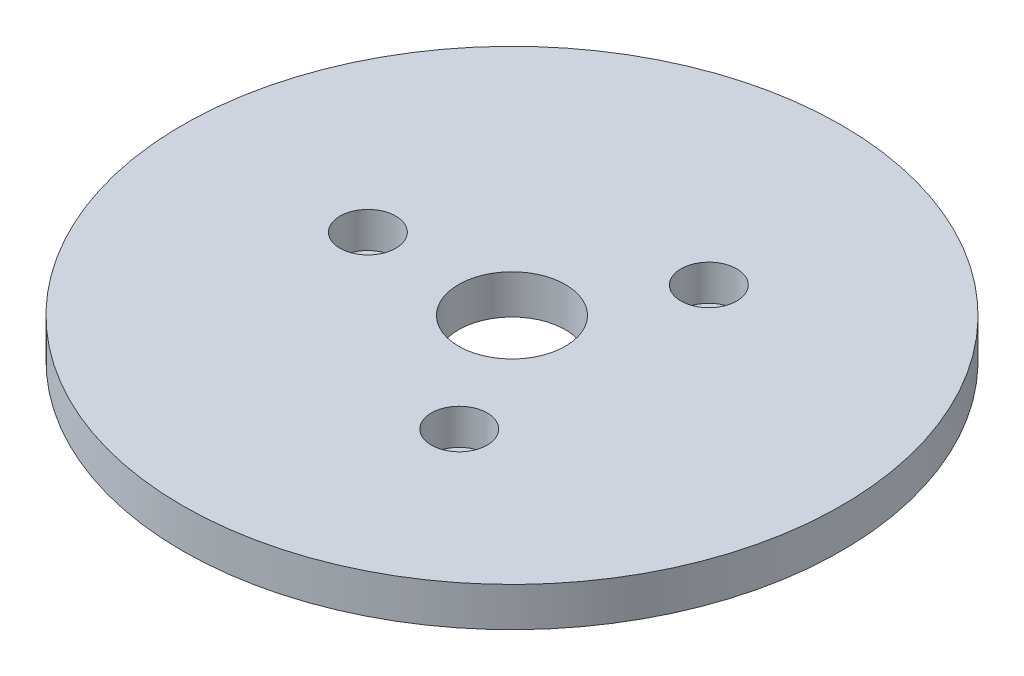
ISO-10303-21;
HEADER;
FILE_DESCRIPTION(('STEP AP214'),'2;1');
FILE_NAME('part.step','',(''),(''),'','','');
FILE_SCHEMA(('AUTOMOTIVE_DESIGN { 1 0 10303 214 1 1 1 1 }'));
ENDSEC;
DATA;
#1=APPLICATION_CONTEXT('core data for automotive mechanical design processes');
#2=APPLICATION_PROTOCOL_DEFINITION('international standard','automotive_design',2000,#1);
#3=PRODUCT_CONTEXT('',#1,'mechanical');
#4=PRODUCT('Part','Part','',(#3));
#5=PRODUCT_RELATED_PRODUCT_CATEGORY('part','',(#4));
#6=PRODUCT_DEFINITION_FORMATION('','',#4);
#7=PRODUCT_DEFINITION_CONTEXT('part definition',#1,'design');
#8=PRODUCT_DEFINITION('design','',#6,#7);
#9=PRODUCT_DEFINITION_SHAPE('','',#8);
#10=(LENGTH_UNIT() NAMED_UNIT(*) SI_UNIT(.MILLI.,.METRE.));
#11=(NAMED_UNIT(*) PLANE_ANGLE_UNIT() SI_UNIT($,.RADIAN.));
#12=(NAMED_UNIT(*) SI_UNIT($,.STERADIAN.) SOLID_ANGLE_UNIT());
#13=UNCERTAINTY_MEASURE_WITH_UNIT(LENGTH_MEASURE(1.E-05),#10,'distance_accuracy_value','');
#14=(GEOMETRIC_REPRESENTATION_CONTEXT(3) GLOBAL_UNCERTAINTY_ASSIGNED_CONTEXT((#13)) GLOBAL_UNIT_ASSIGNED_CONTEXT((#10,
#11,#12)) REPRESENTATION_CONTEXT('',''));
#15=CARTESIAN_POINT('',(0.,0.,0.));
#16=DIRECTION('',(0.,0.,1.));
#17=DIRECTION('',(1.,0.,0.));
#18=AXIS2_PLACEMENT_3D('',#15,#16,#17);
#19=CARTESIAN_POINT('',(0.,11.,0.));
#20=DIRECTION('',(0.,-1.,0.));
#21=DIRECTION('',(0.,0.,-1.));
#22=AXIS2_PLACEMENT_3D('',#19,#20,#21);
#23=CYLINDRICAL_SURFACE('',#22,92.5);
#24=CARTESIAN_POINT('',(0.,11.,0.));
#25=DIRECTION('',(0.,1.,0.));
#26=DIRECTION('',(0.,0.,1.));
#27=AXIS2_PLACEMENT_3D('',#24,#25,#26);
#28=CIRCLE('',#27,92.5);
#29=CARTESIAN_POINT('',(0.,11.,92.5));
#30=VERTEX_POINT('',#29);
#31=EDGE_CURVE('E10',#30,#30,#28,.T.);
#32=ORIENTED_EDGE('',*,*,#31,.F.);
#33=EDGE_LOOP('',(#32));
#34=FACE_BOUND('',#33,.T.);
#35=CARTESIAN_POINT('',(0.,0.,0.));
#36=DIRECTION('',(0.,1.,0.));
#37=DIRECTION('',(0.,0.,1.));
#38=AXIS2_PLACEMENT_3D('',#35,#36,#37);
#39=CIRCLE('',#38,92.5);
#40=CARTESIAN_POINT('',(0.,0.,92.5));
#41=VERTEX_POINT('',#40);
#42=EDGE_CURVE('E37',#41,#41,#39,.T.);
#43=ORIENTED_EDGE('',*,*,#42,.T.);
#44=EDGE_LOOP('',(#43));
#45=FACE_BOUND('',#44,.T.);
#46=ADVANCED_FACE('F40',(#34,#45),#23,.T.);
#47=CARTESIAN_POINT('',(0.,11.,0.));
#48=DIRECTION('',(0.,1.,0.));
#49=DIRECTION('',(0.,0.,1.));
#50=AXIS2_PLACEMENT_3D('',#47,#48,#49);
#51=PLANE('',#50);
#52=CARTESIAN_POINT('',(20.2230390066846,11.,35.0273310430247));
#53=DIRECTION('',(0.,1.,0.));
#54=DIRECTION('',(0.866025403784436,0.,-0.500000000000004));
#55=AXIS2_PLACEMENT_3D('',#52,#53,#54);
#56=CIRCLE('',#55,7.83759726769559);
#57=CARTESIAN_POINT('',(27.0105973451405,11.,31.1085324091768));
#58=VERTEX_POINT('',#57);
#59=EDGE_CURVE('E70',#58,#58,#56,.T.);
#60=ORIENTED_EDGE('',*,*,#59,.F.);
#61=EDGE_LOOP('',(#60));
#62=FACE_BOUND('',#61,.T.);
#63=CARTESIAN_POINT('',(20.2230390066841,11.,-35.0273310430249));
#64=DIRECTION('',(0.,1.,0.));
#65=DIRECTION('',(-0.866025403784443,0.,-0.499999999999992));
#66=AXIS2_PLACEMENT_3D('',#63,#64,#65);
#67=CIRCLE('',#66,7.83759726769559);
#68=CARTESIAN_POINT('',(13.4354806682282,11.,-38.9461296768727));
#69=VERTEX_POINT('',#68);
#70=EDGE_CURVE('E61',#69,#69,#67,.T.);
#71=ORIENTED_EDGE('',*,*,#70,.F.);
#72=EDGE_LOOP('',(#71));
#73=FACE_BOUND('',#72,.T.);
#74=CARTESIAN_POINT('',(-40.4460780133689,11.,0.));
#75=DIRECTION('',(0.,1.,0.));
#76=DIRECTION('',(0.,0.,1.));
#77=AXIS2_PLACEMENT_3D('',#74,#75,#76);
#78=CIRCLE('',#77,7.83759726769559);
#79=CARTESIAN_POINT('',(-40.4460780133689,11.,7.83759726769559));
#80=VERTEX_POINT('',#79);
#81=EDGE_CURVE('E54',#80,#80,#78,.T.);
#82=ORIENTED_EDGE('',*,*,#81,.F.);
#83=EDGE_LOOP('',(#82));
#84=FACE_BOUND('',#83,.T.);
#85=CARTESIAN_POINT('',(0.,11.,0.));
#86=DIRECTION('',(0.,1.,0.));
#87=DIRECTION('',(0.,0.,1.));
#88=AXIS2_PLACEMENT_3D('',#85,#86,#87);
#89=CIRCLE('',#88,15.);
#90=CARTESIAN_POINT('',(0.,11.,15.));
#91=VERTEX_POINT('',#90);
#92=EDGE_CURVE('E50',#91,#91,#89,.T.);
#93=ORIENTED_EDGE('',*,*,#92,.F.);
#94=EDGE_LOOP('',(#93));
#95=FACE_BOUND('',#94,.T.);
#96=ORIENTED_EDGE('',*,*,#31,.T.);
#97=EDGE_LOOP('',(#96));
#98=FACE_BOUND('',#97,.T.);
#99=ADVANCED_FACE('F85',(#62,#73,#84,#95,#98),#51,.T.);
#100=CARTESIAN_POINT('',(0.,0.,0.));
#101=DIRECTION('',(0.,1.,0.));
#102=DIRECTION('',(0.,0.,1.));
#103=AXIS2_PLACEMENT_3D('',#100,#101,#102);
#104=PLANE('',#103);
#105=CARTESIAN_POINT('',(0.,0.,0.));
#106=DIRECTION('',(0.,1.,0.));
#107=DIRECTION('',(0.,0.,1.));
#108=AXIS2_PLACEMENT_3D('',#105,#106,#107);
#109=CIRCLE('',#108,15.);
#110=CARTESIAN_POINT('',(0.,0.,15.));
#111=VERTEX_POINT('',#110);
#112=EDGE_CURVE('E47',#111,#111,#109,.T.);
#113=ORIENTED_EDGE('',*,*,#112,.T.);
#114=EDGE_LOOP('',(#113));
#115=FACE_BOUND('',#114,.T.);
#116=ORIENTED_EDGE('',*,*,#42,.F.);
#117=EDGE_LOOP('',(#116));
#118=FACE_BOUND('',#117,.T.);
#119=ADVANCED_FACE('F84',(#115,#118),#104,.F.);
#120=CARTESIAN_POINT('',(0.,11.,0.));
#121=DIRECTION('',(0.,-1.,0.));
#122=DIRECTION('',(0.,0.,-1.));
#123=AXIS2_PLACEMENT_3D('',#120,#121,#122);
#124=CYLINDRICAL_SURFACE('',#123,15.);
#125=ORIENTED_EDGE('',*,*,#92,.T.);
#126=EDGE_LOOP('',(#125));
#127=FACE_BOUND('',#126,.T.);
#128=ORIENTED_EDGE('',*,*,#112,.F.);
#129=EDGE_LOOP('',(#128));
#130=FACE_BOUND('',#129,.T.);
#131=ADVANCED_FACE('F91',(#127,#130),#124,.F.);
#132=CARTESIAN_POINT('',(-40.4460780133689,0.994297939022091,0.));
#133=DIRECTION('',(0.,1.,0.));
#134=DIRECTION('',(0.,0.,1.));
#135=AXIS2_PLACEMENT_3D('',#132,#133,#134);
#136=CYLINDRICAL_SURFACE('',#135,7.83759726769559);
#137=CARTESIAN_POINT('',(-40.4460780133689,0.994297939022091,0.));
#138=DIRECTION('',(0.,1.,0.));
#139=DIRECTION('',(0.,0.,1.));
#140=AXIS2_PLACEMENT_3D('',#137,#138,#139);
#141=CIRCLE('',#140,7.83759726769559);
#142=CARTESIAN_POINT('',(-40.4460780133689,0.994297939022091,7.83759726769559));
#143=VERTEX_POINT('',#142);
#144=EDGE_CURVE('E55',#143,#143,#141,.T.);
#145=ORIENTED_EDGE('',*,*,#144,.F.);
#146=EDGE_LOOP('',(#145));
#147=FACE_BOUND('',#146,.T.);
#148=ORIENTED_EDGE('',*,*,#81,.T.);
#149=EDGE_LOOP('',(#148));
#150=FACE_BOUND('',#149,.T.);
#151=ADVANCED_FACE('F96',(#147,#150),#136,.F.);
#152=CARTESIAN_POINT('',(-40.4460780133689,0.994297939022091,0.));
#153=DIRECTION('',(0.,1.,0.));
#154=DIRECTION('',(0.,0.,1.));
#155=AXIS2_PLACEMENT_3D('',#152,#153,#154);
#156=PLANE('',#155);
#157=ORIENTED_EDGE('',*,*,#144,.T.);
#158=EDGE_LOOP('',(#157));
#159=FACE_BOUND('',#158,.T.);
#160=ADVANCED_FACE('F127',(#159),#156,.T.);
#161=CARTESIAN_POINT('',(20.2230390066841,0.994297939022091,-35.0273310430249));
#162=DIRECTION('',(0.,1.,0.));
#163=DIRECTION('',(0.,0.,1.));
#164=AXIS2_PLACEMENT_3D('',#161,#162,#163);
#165=CYLINDRICAL_SURFACE('',#164,7.83759726769559);
#166=CARTESIAN_POINT('',(20.2230390066841,0.994297939022091,-35.0273310430249));
#167=DIRECTION('',(0.,1.,0.));
#168=DIRECTION('',(-0.866025403784443,0.,-0.499999999999992));
#169=AXIS2_PLACEMENT_3D('',#166,#167,#168);
#170=CIRCLE('',#169,7.83759726769559);
#171=CARTESIAN_POINT('',(13.4354806682282,0.994297939022091,-38.9461296768727));
#172=VERTEX_POINT('',#171);
#173=EDGE_CURVE('E63',#172,#172,#170,.T.);
#174=ORIENTED_EDGE('',*,*,#173,.F.);
#175=EDGE_LOOP('',(#174));
#176=FACE_BOUND('',#175,.T.);
#177=ORIENTED_EDGE('',*,*,#70,.T.);
#178=EDGE_LOOP('',(#177));
#179=FACE_BOUND('',#178,.T.);
#180=ADVANCED_FACE('F133',(#176,#179),#165,.F.);
#181=CARTESIAN_POINT('',(20.2230390066841,0.994297939022091,-35.0273310430249));
#182=DIRECTION('',(0.,1.,0.));
#183=DIRECTION('',(-0.866025403784443,0.,-0.499999999999992));
#184=AXIS2_PLACEMENT_3D('',#181,#182,#183);
#185=PLANE('',#184);
#186=ORIENTED_EDGE('',*,*,#173,.T.);
#187=EDGE_LOOP('',(#186));
#188=FACE_BOUND('',#187,.T.);
#189=ADVANCED_FACE('F77',(#188),#185,.T.);
#190=CARTESIAN_POINT('',(20.2230390066846,0.994297939022091,35.0273310430247));
#191=DIRECTION('',(0.,1.,0.));
#192=DIRECTION('',(0.,0.,1.));
#193=AXIS2_PLACEMENT_3D('',#190,#191,#192);
#194=CYLINDRICAL_SURFACE('',#193,7.83759726769559);
#195=CARTESIAN_POINT('',(20.2230390066846,0.994297939022091,35.0273310430247));
#196=DIRECTION('',(0.,1.,0.));
#197=DIRECTION('',(0.866025403784436,0.,-0.500000000000004));
#198=AXIS2_PLACEMENT_3D('',#195,#196,#197);
#199=CIRCLE('',#198,7.83759726769559);
#200=CARTESIAN_POINT('',(27.0105973451405,0.994297939022091,31.1085324091768));
#201=VERTEX_POINT('',#200);
#202=EDGE_CURVE('E59',#201,#201,#199,.T.);
#203=ORIENTED_EDGE('',*,*,#202,.F.);
#204=EDGE_LOOP('',(#203));
#205=FACE_BOUND('',#204,.T.);
#206=ORIENTED_EDGE('',*,*,#59,.T.);
#207=EDGE_LOOP('',(#206));
#208=FACE_BOUND('',#207,.T.);
#209=ADVANCED_FACE('F73',(#205,#208),#194,.F.);
#210=CARTESIAN_POINT('',(20.2230390066846,0.994297939022091,35.0273310430247));
#211=DIRECTION('',(0.,1.,0.));
#212=DIRECTION('',(0.866025403784436,0.,-0.500000000000004));
#213=AXIS2_PLACEMENT_3D('',#210,#211,#212);
#214=PLANE('',#213);
#215=ORIENTED_EDGE('',*,*,#202,.T.);
#216=EDGE_LOOP('',(#215));
#217=FACE_BOUND('',#216,.T.);
#218=ADVANCED_FACE('F71',(#217),#214,.T.);
#219=CLOSED_SHELL('',(#46,#99,#119,#131,#151,#160,#180,#189,#209,#218));
#220=MANIFOLD_SOLID_BREP('B2',#219);
#221=ADVANCED_BREP_SHAPE_REPRESENTATION('',(#18,#220),#14);
#222=SHAPE_DEFINITION_REPRESENTATION(#9,#221);
ENDSEC;
END-ISO-10303-21;
